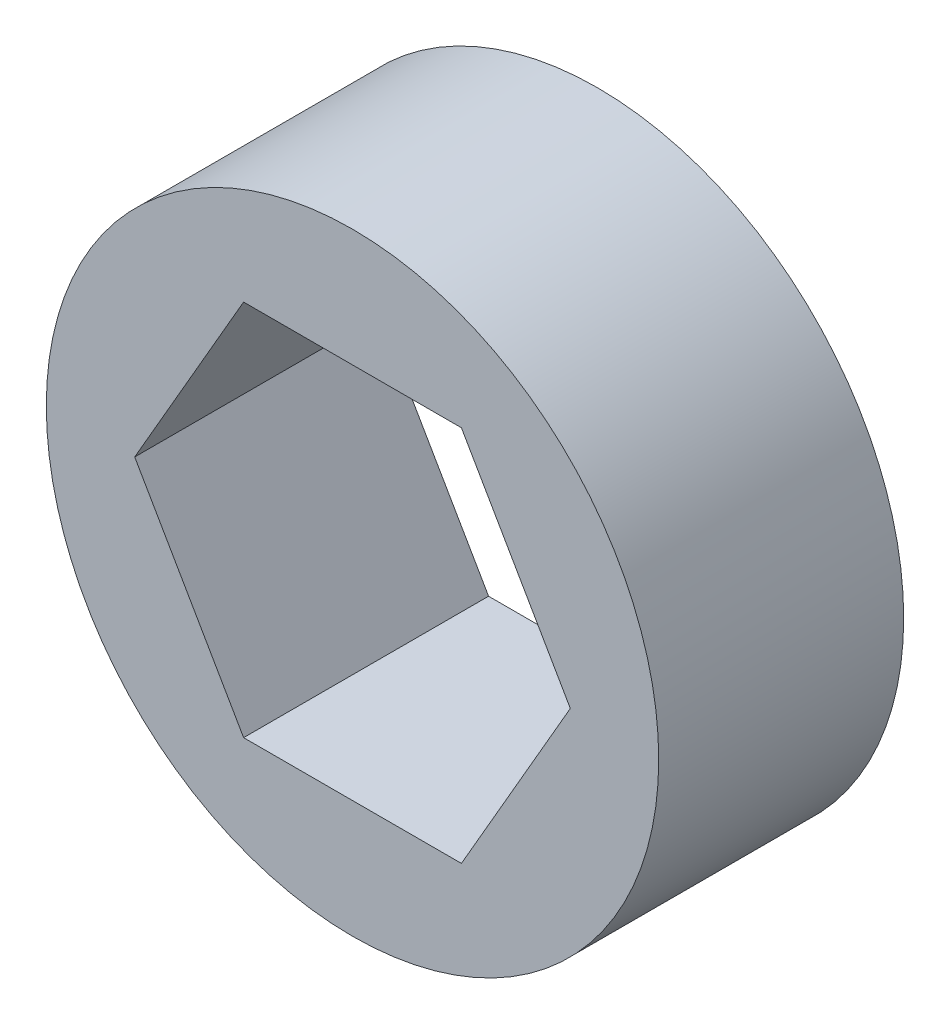
ISO-10303-21;
HEADER;
FILE_DESCRIPTION(('STEP AP214'),'2;1');
FILE_NAME('part.step','',(''),(''),'','','');
FILE_SCHEMA(('AUTOMOTIVE_DESIGN { 1 0 10303 214 1 1 1 1 }'));
ENDSEC;
DATA;
#1=APPLICATION_CONTEXT('core data for automotive mechanical design processes');
#2=APPLICATION_PROTOCOL_DEFINITION('international standard','automotive_design',2000,#1);
#3=PRODUCT_CONTEXT('',#1,'mechanical');
#4=PRODUCT('Part','Part','',(#3));
#5=PRODUCT_RELATED_PRODUCT_CATEGORY('part','',(#4));
#6=PRODUCT_DEFINITION_FORMATION('','',#4);
#7=PRODUCT_DEFINITION_CONTEXT('part definition',#1,'design');
#8=PRODUCT_DEFINITION('design','',#6,#7);
#9=PRODUCT_DEFINITION_SHAPE('','',#8);
#10=(LENGTH_UNIT() NAMED_UNIT(*) SI_UNIT(.MILLI.,.METRE.));
#11=(NAMED_UNIT(*) PLANE_ANGLE_UNIT() SI_UNIT($,.RADIAN.));
#12=(NAMED_UNIT(*) SI_UNIT($,.STERADIAN.) SOLID_ANGLE_UNIT());
#13=UNCERTAINTY_MEASURE_WITH_UNIT(LENGTH_MEASURE(1.E-05),#10,'distance_accuracy_value','');
#14=(GEOMETRIC_REPRESENTATION_CONTEXT(3) GLOBAL_UNCERTAINTY_ASSIGNED_CONTEXT((#13)) GLOBAL_UNIT_ASSIGNED_CONTEXT((#10,
#11,#12)) REPRESENTATION_CONTEXT('',''));
#15=CARTESIAN_POINT('',(0.,0.,0.));
#16=DIRECTION('',(0.,0.,1.));
#17=DIRECTION('',(1.,0.,0.));
#18=AXIS2_PLACEMENT_3D('',#15,#16,#17);
#19=CARTESIAN_POINT('',(-5.64590828240535,0.,3.175));
#20=DIRECTION('',(0.866025403784439,0.5,0.));
#21=DIRECTION('',(-0.5,0.866025403784439,0.));
#22=AXIS2_PLACEMENT_3D('',#19,#20,#21);
#23=PLANE('',#22);
#24=DIRECTION('',(-0.5,0.866025403784439,0.));
#25=VECTOR('',#24,1.);
#26=CARTESIAN_POINT('',(-2.82295414120268,-4.8895,3.175));
#27=LINE('',#26,#25);
#28=CARTESIAN_POINT('',(-2.82295414120268,-4.8895,3.175));
#29=VERTEX_POINT('',#28);
#30=CARTESIAN_POINT('',(-5.64590828240535,0.,3.175));
#31=VERTEX_POINT('',#30);
#32=EDGE_CURVE('E83',#29,#31,#27,.T.);
#33=ORIENTED_EDGE('',*,*,#32,.F.);
#34=DIRECTION('',(0.,0.,1.));
#35=VECTOR('',#34,1.);
#36=CARTESIAN_POINT('',(-2.82295414120268,-4.8895,3.175));
#37=LINE('',#36,#35);
#38=CARTESIAN_POINT('',(-2.82295414120268,-4.8895,-3.175));
#39=VERTEX_POINT('',#38);
#40=EDGE_CURVE('E75',#39,#29,#37,.T.);
#41=ORIENTED_EDGE('',*,*,#40,.F.);
#42=DIRECTION('',(-0.5,0.866025403784439,0.));
#43=VECTOR('',#42,1.);
#44=CARTESIAN_POINT('',(-2.82295414120268,-4.8895,-3.175));
#45=LINE('',#44,#43);
#46=CARTESIAN_POINT('',(-5.64590828240535,0.,-3.175));
#47=VERTEX_POINT('',#46);
#48=EDGE_CURVE('E115',#39,#47,#45,.T.);
#49=ORIENTED_EDGE('',*,*,#48,.T.);
#50=DIRECTION('',(0.,0.,1.));
#51=VECTOR('',#50,1.);
#52=CARTESIAN_POINT('',(-5.64590828240535,0.,3.175));
#53=LINE('',#52,#51);
#54=EDGE_CURVE('E100',#31,#47,#53,.F.);
#55=ORIENTED_EDGE('',*,*,#54,.F.);
#56=EDGE_LOOP('',(#33,#41,#49,#55));
#57=FACE_BOUND('',#56,.T.);
#58=ADVANCED_FACE('F16',(#57),#23,.T.);
#59=CARTESIAN_POINT('',(-2.82295414120268,4.8895,3.175));
#60=DIRECTION('',(0.866025403784439,-0.5,0.));
#61=DIRECTION('',(0.5,0.866025403784439,0.));
#62=AXIS2_PLACEMENT_3D('',#59,#60,#61);
#63=PLANE('',#62);
#64=DIRECTION('',(0.5,0.866025403784439,0.));
#65=VECTOR('',#64,1.);
#66=CARTESIAN_POINT('',(-5.64590828240535,0.,3.175));
#67=LINE('',#66,#65);
#68=CARTESIAN_POINT('',(-2.82295414120268,4.8895,3.175));
#69=VERTEX_POINT('',#68);
#70=EDGE_CURVE('E108',#31,#69,#67,.T.);
#71=ORIENTED_EDGE('',*,*,#70,.F.);
#72=ORIENTED_EDGE('',*,*,#54,.T.);
#73=DIRECTION('',(0.5,0.866025403784439,0.));
#74=VECTOR('',#73,1.);
#75=CARTESIAN_POINT('',(-5.64590828240535,0.,-3.175));
#76=LINE('',#75,#74);
#77=CARTESIAN_POINT('',(-2.82295414120268,4.8895,-3.175));
#78=VERTEX_POINT('',#77);
#79=EDGE_CURVE('E106',#47,#78,#76,.T.);
#80=ORIENTED_EDGE('',*,*,#79,.T.);
#81=DIRECTION('',(0.,0.,1.));
#82=VECTOR('',#81,1.);
#83=CARTESIAN_POINT('',(-2.82295414120268,4.8895,3.175));
#84=LINE('',#83,#82);
#85=EDGE_CURVE('E97',#69,#78,#84,.F.);
#86=ORIENTED_EDGE('',*,*,#85,.F.);
#87=EDGE_LOOP('',(#71,#72,#80,#86));
#88=FACE_BOUND('',#87,.T.);
#89=ADVANCED_FACE('F105',(#88),#63,.T.);
#90=CARTESIAN_POINT('',(2.82295414120267,4.8895,3.175));
#91=DIRECTION('',(0.,-1.,0.));
#92=DIRECTION('',(1.,0.,0.));
#93=AXIS2_PLACEMENT_3D('',#90,#91,#92);
#94=PLANE('',#93);
#95=DIRECTION('',(1.,0.,0.));
#96=VECTOR('',#95,1.);
#97=CARTESIAN_POINT('',(0.,4.8895,3.175));
#98=LINE('',#97,#96);
#99=CARTESIAN_POINT('',(2.82295414120267,4.8895,3.175));
#100=VERTEX_POINT('',#99);
#101=EDGE_CURVE('E125',#69,#100,#98,.T.);
#102=ORIENTED_EDGE('',*,*,#101,.F.);
#103=ORIENTED_EDGE('',*,*,#85,.T.);
#104=DIRECTION('',(1.,0.,0.));
#105=VECTOR('',#104,1.);
#106=CARTESIAN_POINT('',(0.,4.8895,-3.175));
#107=LINE('',#106,#105);
#108=CARTESIAN_POINT('',(2.82295414120267,4.8895,-3.175));
#109=VERTEX_POINT('',#108);
#110=EDGE_CURVE('E117',#78,#109,#107,.T.);
#111=ORIENTED_EDGE('',*,*,#110,.T.);
#112=DIRECTION('',(0.,0.,1.));
#113=VECTOR('',#112,1.);
#114=CARTESIAN_POINT('',(2.82295414120267,4.8895,3.175));
#115=LINE('',#114,#113);
#116=EDGE_CURVE('E94',#100,#109,#115,.F.);
#117=ORIENTED_EDGE('',*,*,#116,.F.);
#118=EDGE_LOOP('',(#102,#103,#111,#117));
#119=FACE_BOUND('',#118,.T.);
#120=ADVANCED_FACE('F134',(#119),#94,.T.);
#121=CARTESIAN_POINT('',(5.64590828240535,0.,3.175));
#122=DIRECTION('',(-0.866025403784438,-0.500000000000001,0.));
#123=DIRECTION('',(0.500000000000001,-0.866025403784438,0.));
#124=AXIS2_PLACEMENT_3D('',#121,#122,#123);
#125=PLANE('',#124);
#126=DIRECTION('',(0.5,-0.866025403784438,0.));
#127=VECTOR('',#126,1.);
#128=CARTESIAN_POINT('',(2.82295414120267,4.8895,3.175));
#129=LINE('',#128,#127);
#130=CARTESIAN_POINT('',(5.64590828240535,0.,3.175));
#131=VERTEX_POINT('',#130);
#132=EDGE_CURVE('E88',#100,#131,#129,.T.);
#133=ORIENTED_EDGE('',*,*,#132,.F.);
#134=ORIENTED_EDGE('',*,*,#116,.T.);
#135=DIRECTION('',(0.5,-0.866025403784438,0.));
#136=VECTOR('',#135,1.);
#137=CARTESIAN_POINT('',(2.82295414120267,4.8895,-3.175));
#138=LINE('',#137,#136);
#139=CARTESIAN_POINT('',(5.64590828240535,0.,-3.175));
#140=VERTEX_POINT('',#139);
#141=EDGE_CURVE('E119',#109,#140,#138,.T.);
#142=ORIENTED_EDGE('',*,*,#141,.T.);
#143=DIRECTION('',(0.,0.,1.));
#144=VECTOR('',#143,1.);
#145=CARTESIAN_POINT('',(5.64590828240535,0.,3.175));
#146=LINE('',#145,#144);
#147=EDGE_CURVE('E64',#131,#140,#146,.F.);
#148=ORIENTED_EDGE('',*,*,#147,.F.);
#149=EDGE_LOOP('',(#133,#134,#142,#148));
#150=FACE_BOUND('',#149,.T.);
#151=ADVANCED_FACE('F131',(#150),#125,.T.);
#152=CARTESIAN_POINT('',(2.82295414120268,-4.8895,3.175));
#153=DIRECTION('',(-0.866025403784439,0.5,0.));
#154=DIRECTION('',(-0.5,-0.866025403784439,0.));
#155=AXIS2_PLACEMENT_3D('',#152,#153,#154);
#156=PLANE('',#155);
#157=DIRECTION('',(-0.5,-0.866025403784439,0.));
#158=VECTOR('',#157,1.);
#159=CARTESIAN_POINT('',(5.64590828240535,0.,3.175));
#160=LINE('',#159,#158);
#161=CARTESIAN_POINT('',(2.82295414120268,-4.8895,3.175));
#162=VERTEX_POINT('',#161);
#163=EDGE_CURVE('E70',#131,#162,#160,.T.);
#164=ORIENTED_EDGE('',*,*,#163,.F.);
#165=ORIENTED_EDGE('',*,*,#147,.T.);
#166=DIRECTION('',(-0.5,-0.866025403784439,0.));
#167=VECTOR('',#166,1.);
#168=CARTESIAN_POINT('',(5.64590828240535,0.,-3.175));
#169=LINE('',#168,#167);
#170=CARTESIAN_POINT('',(2.82295414120268,-4.8895,-3.175));
#171=VERTEX_POINT('',#170);
#172=EDGE_CURVE('E32',#140,#171,#169,.T.);
#173=ORIENTED_EDGE('',*,*,#172,.T.);
#174=DIRECTION('',(0.,0.,1.));
#175=VECTOR('',#174,1.);
#176=CARTESIAN_POINT('',(2.82295414120268,-4.8895,3.175));
#177=LINE('',#176,#175);
#178=EDGE_CURVE('E66',#162,#171,#177,.F.);
#179=ORIENTED_EDGE('',*,*,#178,.F.);
#180=EDGE_LOOP('',(#164,#165,#173,#179));
#181=FACE_BOUND('',#180,.T.);
#182=ADVANCED_FACE('F68',(#181),#156,.T.);
#183=CARTESIAN_POINT('',(-2.82295414120268,-4.8895,3.175));
#184=DIRECTION('',(0.,1.,0.));
#185=DIRECTION('',(-1.,0.,0.));
#186=AXIS2_PLACEMENT_3D('',#183,#184,#185);
#187=PLANE('',#186);
#188=DIRECTION('',(1.,0.,0.));
#189=VECTOR('',#188,1.);
#190=CARTESIAN_POINT('',(0.,-4.8895,3.175));
#191=LINE('',#190,#189);
#192=EDGE_CURVE('E78',#162,#29,#191,.F.);
#193=ORIENTED_EDGE('',*,*,#192,.F.);
#194=ORIENTED_EDGE('',*,*,#178,.T.);
#195=DIRECTION('',(1.,0.,0.));
#196=VECTOR('',#195,1.);
#197=CARTESIAN_POINT('',(0.,-4.8895,-3.175));
#198=LINE('',#197,#196);
#199=EDGE_CURVE('E127',#171,#39,#198,.F.);
#200=ORIENTED_EDGE('',*,*,#199,.T.);
#201=ORIENTED_EDGE('',*,*,#40,.T.);
#202=EDGE_LOOP('',(#193,#194,#200,#201));
#203=FACE_BOUND('',#202,.T.);
#204=ADVANCED_FACE('F79',(#203),#187,.T.);
#205=CARTESIAN_POINT('',(0.,0.,3.175));
#206=DIRECTION('',(0.,0.,1.));
#207=DIRECTION('',(1.,0.,0.));
#208=AXIS2_PLACEMENT_3D('',#205,#206,#207);
#209=PLANE('',#208);
#210=ORIENTED_EDGE('',*,*,#101,.T.);
#211=ORIENTED_EDGE('',*,*,#132,.T.);
#212=ORIENTED_EDGE('',*,*,#163,.T.);
#213=ORIENTED_EDGE('',*,*,#192,.T.);
#214=ORIENTED_EDGE('',*,*,#32,.T.);
#215=ORIENTED_EDGE('',*,*,#70,.T.);
#216=EDGE_LOOP('',(#210,#211,#212,#213,#214,#215));
#217=FACE_BOUND('',#216,.T.);
#218=CARTESIAN_POINT('',(0.,0.,3.175));
#219=DIRECTION('',(0.,0.,-1.));
#220=DIRECTION('',(-1.,0.,0.));
#221=AXIS2_PLACEMENT_3D('',#218,#219,#220);
#222=CIRCLE('',#221,7.9375);
#223=CARTESIAN_POINT('',(-7.9375,0.,3.175));
#224=VERTEX_POINT('',#223);
#225=EDGE_CURVE('E19',#224,#224,#222,.T.);
#226=ORIENTED_EDGE('',*,*,#225,.F.);
#227=EDGE_LOOP('',(#226));
#228=FACE_BOUND('',#227,.T.);
#229=ADVANCED_FACE('F86',(#217,#228),#209,.T.);
#230=CARTESIAN_POINT('',(0.,0.,-3.175));
#231=DIRECTION('',(0.,0.,1.));
#232=DIRECTION('',(1.,0.,0.));
#233=AXIS2_PLACEMENT_3D('',#230,#231,#232);
#234=PLANE('',#233);
#235=ORIENTED_EDGE('',*,*,#172,.F.);
#236=ORIENTED_EDGE('',*,*,#141,.F.);
#237=ORIENTED_EDGE('',*,*,#110,.F.);
#238=ORIENTED_EDGE('',*,*,#79,.F.);
#239=ORIENTED_EDGE('',*,*,#48,.F.);
#240=ORIENTED_EDGE('',*,*,#199,.F.);
#241=EDGE_LOOP('',(#235,#236,#237,#238,#239,#240));
#242=FACE_BOUND('',#241,.T.);
#243=CARTESIAN_POINT('',(0.,0.,-3.175));
#244=DIRECTION('',(0.,0.,-1.));
#245=DIRECTION('',(-1.,0.,0.));
#246=AXIS2_PLACEMENT_3D('',#243,#244,#245);
#247=CIRCLE('',#246,7.9375);
#248=CARTESIAN_POINT('',(-7.9375,0.,-3.175));
#249=VERTEX_POINT('',#248);
#250=EDGE_CURVE('E10',#249,#249,#247,.F.);
#251=ORIENTED_EDGE('',*,*,#250,.F.);
#252=EDGE_LOOP('',(#251));
#253=FACE_BOUND('',#252,.T.);
#254=ADVANCED_FACE('F113',(#242,#253),#234,.F.);
#255=CARTESIAN_POINT('',(0.,0.,3.175));
#256=DIRECTION('',(0.,0.,-1.));
#257=DIRECTION('',(-1.,0.,0.));
#258=AXIS2_PLACEMENT_3D('',#255,#256,#257);
#259=CYLINDRICAL_SURFACE('',#258,7.9375);
#260=ORIENTED_EDGE('',*,*,#250,.T.);
#261=EDGE_LOOP('',(#260));
#262=FACE_BOUND('',#261,.T.);
#263=ORIENTED_EDGE('',*,*,#225,.T.);
#264=EDGE_LOOP('',(#263));
#265=FACE_BOUND('',#264,.T.);
#266=ADVANCED_FACE('F143',(#262,#265),#259,.T.);
#267=CLOSED_SHELL('',(#58,#89,#120,#151,#182,#204,#229,#254,#266));
#268=MANIFOLD_SOLID_BREP('B1',#267);
#269=ADVANCED_BREP_SHAPE_REPRESENTATION('',(#18,#268),#14);
#270=SHAPE_DEFINITION_REPRESENTATION(#9,#269);
ENDSEC;
END-ISO-10303-21;
